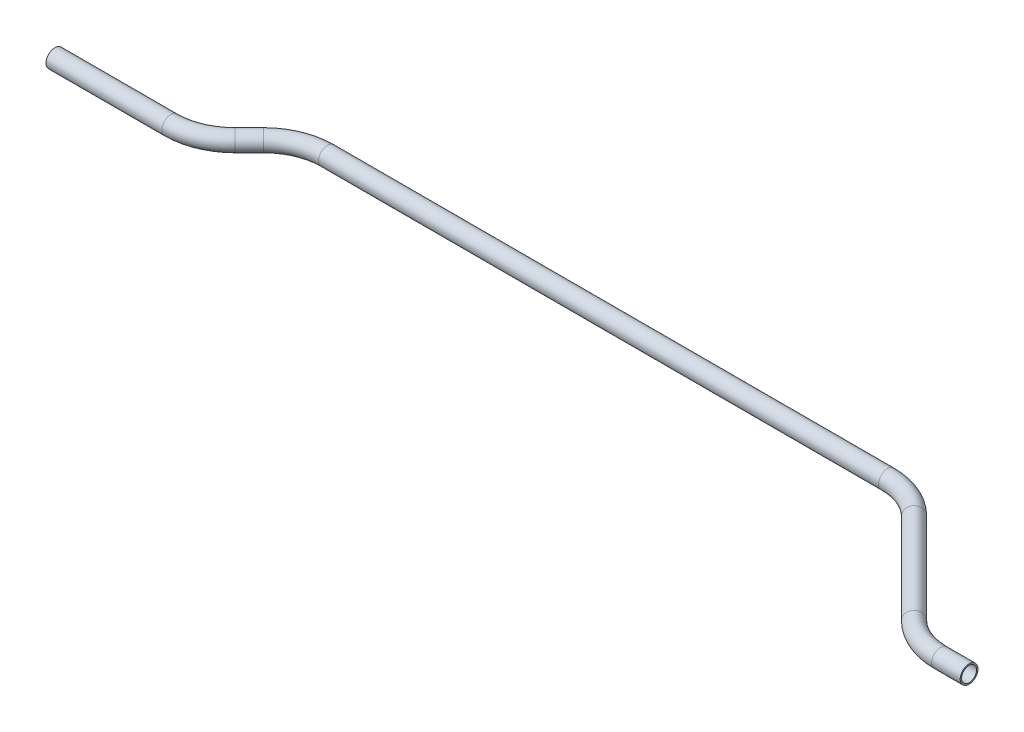
ISO-10303-21;
HEADER;
FILE_DESCRIPTION(('STEP AP214'),'2;1');
FILE_NAME('part.step','',(''),(''),'','','');
FILE_SCHEMA(('AUTOMOTIVE_DESIGN { 1 0 10303 214 1 1 1 1 }'));
ENDSEC;
DATA;
#1=APPLICATION_CONTEXT('core data for automotive mechanical design processes');
#2=APPLICATION_PROTOCOL_DEFINITION('international standard','automotive_design',2000,#1);
#3=PRODUCT_CONTEXT('',#1,'mechanical');
#4=PRODUCT('Part','Part','',(#3));
#5=PRODUCT_RELATED_PRODUCT_CATEGORY('part','',(#4));
#6=PRODUCT_DEFINITION_FORMATION('','',#4);
#7=PRODUCT_DEFINITION_CONTEXT('part definition',#1,'design');
#8=PRODUCT_DEFINITION('design','',#6,#7);
#9=PRODUCT_DEFINITION_SHAPE('','',#8);
#10=(LENGTH_UNIT() NAMED_UNIT(*) SI_UNIT(.MILLI.,.METRE.));
#11=(NAMED_UNIT(*) PLANE_ANGLE_UNIT() SI_UNIT($,.RADIAN.));
#12=(NAMED_UNIT(*) SI_UNIT($,.STERADIAN.) SOLID_ANGLE_UNIT());
#13=UNCERTAINTY_MEASURE_WITH_UNIT(LENGTH_MEASURE(1.E-05),#10,'distance_accuracy_value','');
#14=(GEOMETRIC_REPRESENTATION_CONTEXT(3) GLOBAL_UNCERTAINTY_ASSIGNED_CONTEXT((#13)) GLOBAL_UNIT_ASSIGNED_CONTEXT((#10,
#11,#12)) REPRESENTATION_CONTEXT('',''));
#15=CARTESIAN_POINT('',(0.,0.,0.));
#16=DIRECTION('',(0.,0.,1.));
#17=DIRECTION('',(1.,0.,0.));
#18=AXIS2_PLACEMENT_3D('',#15,#16,#17);
#19=CARTESIAN_POINT('',(0.,0.,0.));
#20=DIRECTION('',(1.,0.,0.));
#21=DIRECTION('',(0.,0.,-1.));
#22=AXIS2_PLACEMENT_3D('',#19,#20,#21);
#23=CYLINDRICAL_SURFACE('',#22,7.9375);
#24=CARTESIAN_POINT('',(103.327694910378,0.,0.));
#25=DIRECTION('',(1.,0.,0.));
#26=DIRECTION('',(0.,0.,-1.));
#27=AXIS2_PLACEMENT_3D('',#24,#25,#26);
#28=CIRCLE('',#27,7.9375);
#29=CARTESIAN_POINT('',(103.327694910378,0.,7.93750000000001));
#30=VERTEX_POINT('',#29);
#31=EDGE_CURVE('E54',#30,#30,#28,.T.);
#32=ORIENTED_EDGE('',*,*,#31,.F.);
#33=EDGE_LOOP('',(#32));
#34=FACE_BOUND('',#33,.T.);
#35=CARTESIAN_POINT('',(0.,0.,0.));
#36=DIRECTION('',(1.,0.,0.));
#37=DIRECTION('',(0.,0.,-1.));
#38=AXIS2_PLACEMENT_3D('',#35,#36,#37);
#39=CIRCLE('',#38,7.9375);
#40=CARTESIAN_POINT('',(0.,0.,-7.9375));
#41=VERTEX_POINT('',#40);
#42=EDGE_CURVE('E51',#41,#41,#39,.T.);
#43=ORIENTED_EDGE('',*,*,#42,.T.);
#44=EDGE_LOOP('',(#43));
#45=FACE_BOUND('',#44,.T.);
#46=ADVANCED_FACE('F30',(#34,#45),#23,.T.);
#47=CARTESIAN_POINT('',(103.327694910378,0.,-57.15));
#48=DIRECTION('',(0.,1.,0.));
#49=DIRECTION('',(0.,0.,1.));
#50=AXIS2_PLACEMENT_3D('',#47,#48,#49);
#51=TOROIDAL_SURFACE('',#50,57.15,7.9375);
#52=CARTESIAN_POINT('',(143.738847455189,0.,-16.7388474551889));
#53=DIRECTION('',(0.707106781186545,0.,-0.70710678118655));
#54=DIRECTION('',(-0.70710678118655,0.,-0.707106781186545));
#55=AXIS2_PLACEMENT_3D('',#52,#53,#54);
#56=CIRCLE('',#55,7.9375);
#57=CARTESIAN_POINT('',(149.351507530857,0.,-11.1261873795207));
#58=VERTEX_POINT('',#57);
#59=EDGE_CURVE('E57',#58,#58,#56,.T.);
#60=CARTESIAN_POINT('',(103.327694910378,0.,-57.15));
#61=DIRECTION('',(0.,1.,0.));
#62=DIRECTION('',(0.,0.,1.));
#63=AXIS2_PLACEMENT_3D('',#60,#61,#62);
#64=CIRCLE('',#63,65.0875);
#65=EDGE_CURVE('',#30,#58,#64,.T.);
#66=ORIENTED_EDGE('',*,*,#31,.T.);
#67=ORIENTED_EDGE('',*,*,#59,.F.);
#68=ORIENTED_EDGE('',*,*,#65,.T.);
#69=ORIENTED_EDGE('',*,*,#65,.F.);
#70=EDGE_LOOP('',(#66,#68,#67,#69));
#71=FACE_BOUND('',#70,.T.);
#72=ADVANCED_FACE('F114',(#71),#51,.T.);
#73=CARTESIAN_POINT('',(143.738847455189,0.,-16.7388474551889));
#74=DIRECTION('',(0.707106781186546,0.,-0.707106781186549));
#75=DIRECTION('',(-0.707106781186549,0.,-0.707106781186546));
#76=AXIS2_PLACEMENT_3D('',#73,#74,#75);
#77=CYLINDRICAL_SURFACE('',#76,7.9375);
#78=CARTESIAN_POINT('',(156.405011336411,0.,-29.4050113364111));
#79=DIRECTION('',(0.707106781186546,0.,-0.707106781186549));
#80=DIRECTION('',(-0.707106781186549,0.,-0.707106781186546));
#81=AXIS2_PLACEMENT_3D('',#78,#79,#80);
#82=CIRCLE('',#81,7.9375);
#83=CARTESIAN_POINT('',(150.792351260743,0.,-35.0176714120793));
#84=VERTEX_POINT('',#83);
#85=EDGE_CURVE('E60',#84,#84,#82,.T.);
#86=ORIENTED_EDGE('',*,*,#85,.F.);
#87=EDGE_LOOP('',(#86));
#88=FACE_BOUND('',#87,.T.);
#89=ORIENTED_EDGE('',*,*,#59,.T.);
#90=EDGE_LOOP('',(#89));
#91=FACE_BOUND('',#90,.T.);
#92=ADVANCED_FACE('F118',(#88,#91),#77,.T.);
#93=CARTESIAN_POINT('',(196.816163881222,0.,11.0061412084));
#94=DIRECTION('',(0.,-1.,0.));
#95=DIRECTION('',(0.,0.,-1.));
#96=AXIS2_PLACEMENT_3D('',#93,#94,#95);
#97=TOROIDAL_SURFACE('',#96,57.15,7.9375);
#98=CARTESIAN_POINT('',(196.816163881222,0.,-46.1438587916));
#99=DIRECTION('',(1.,0.,0.));
#100=DIRECTION('',(0.,0.,-1.));
#101=AXIS2_PLACEMENT_3D('',#98,#99,#100);
#102=CIRCLE('',#101,7.9375);
#103=CARTESIAN_POINT('',(196.816163881222,0.,-54.0813587916));
#104=VERTEX_POINT('',#103);
#105=EDGE_CURVE('E63',#104,#104,#102,.T.);
#106=CARTESIAN_POINT('',(196.816163881222,0.,11.0061412084));
#107=DIRECTION('',(0.,-1.,0.));
#108=DIRECTION('',(0.,0.,-1.));
#109=AXIS2_PLACEMENT_3D('',#106,#107,#108);
#110=CIRCLE('',#109,65.0875);
#111=EDGE_CURVE('',#84,#104,#110,.T.);
#112=ORIENTED_EDGE('',*,*,#85,.T.);
#113=ORIENTED_EDGE('',*,*,#105,.F.);
#114=ORIENTED_EDGE('',*,*,#111,.T.);
#115=ORIENTED_EDGE('',*,*,#111,.F.);
#116=EDGE_LOOP('',(#112,#114,#113,#115));
#117=FACE_BOUND('',#116,.T.);
#118=ADVANCED_FACE('F122',(#117),#97,.T.);
#119=CARTESIAN_POINT('',(196.816163881222,0.,-46.1438587916));
#120=DIRECTION('',(1.,0.,0.));
#121=DIRECTION('',(0.,0.,-1.));
#122=AXIS2_PLACEMENT_3D('',#119,#120,#121);
#123=CYLINDRICAL_SURFACE('',#122,7.9375);
#124=CARTESIAN_POINT('',(696.031788612355,0.,-46.1438587916));
#125=DIRECTION('',(1.,0.,0.));
#126=DIRECTION('',(0.,0.,-1.));
#127=AXIS2_PLACEMENT_3D('',#124,#125,#126);
#128=CIRCLE('',#127,7.9375);
#129=CARTESIAN_POINT('',(696.031788612355,0.,-54.0813587915999));
#130=VERTEX_POINT('',#129);
#131=EDGE_CURVE('E66',#130,#130,#128,.T.);
#132=ORIENTED_EDGE('',*,*,#131,.F.);
#133=EDGE_LOOP('',(#132));
#134=FACE_BOUND('',#133,.T.);
#135=ORIENTED_EDGE('',*,*,#105,.T.);
#136=EDGE_LOOP('',(#135));
#137=FACE_BOUND('',#136,.T.);
#138=ADVANCED_FACE('F126',(#134,#137),#123,.T.);
#139=CARTESIAN_POINT('',(696.031788612355,0.,11.0061412084));
#140=DIRECTION('',(0.,-1.,0.));
#141=DIRECTION('',(0.,0.,-1.));
#142=AXIS2_PLACEMENT_3D('',#139,#140,#141);
#143=TOROIDAL_SURFACE('',#142,57.15,7.9375);
#144=CARTESIAN_POINT('',(736.442941157166,0.,-29.4050113364111));
#145=DIRECTION('',(0.707106781186547,0.,0.707106781186548));
#146=DIRECTION('',(0.707106781186548,0.,-0.707106781186547));
#147=AXIS2_PLACEMENT_3D('',#144,#145,#146);
#148=CIRCLE('',#147,7.9375);
#149=CARTESIAN_POINT('',(742.055601232834,0.,-35.0176714120793));
#150=VERTEX_POINT('',#149);
#151=EDGE_CURVE('E69',#150,#150,#148,.T.);
#152=CARTESIAN_POINT('',(696.031788612355,0.,11.0061412084));
#153=DIRECTION('',(0.,-1.,0.));
#154=DIRECTION('',(0.,0.,-1.));
#155=AXIS2_PLACEMENT_3D('',#152,#153,#154);
#156=CIRCLE('',#155,65.0875);
#157=EDGE_CURVE('',#130,#150,#156,.T.);
#158=ORIENTED_EDGE('',*,*,#131,.T.);
#159=ORIENTED_EDGE('',*,*,#151,.F.);
#160=ORIENTED_EDGE('',*,*,#157,.T.);
#161=ORIENTED_EDGE('',*,*,#157,.F.);
#162=EDGE_LOOP('',(#158,#160,#159,#161));
#163=FACE_BOUND('',#162,.T.);
#164=ADVANCED_FACE('F88',(#163),#143,.T.);
#165=CARTESIAN_POINT('',(736.442941157166,0.,-29.4050113364111));
#166=DIRECTION('',(0.707106781186546,0.,0.707106781186549));
#167=DIRECTION('',(0.707106781186549,0.,-0.707106781186546));
#168=AXIS2_PLACEMENT_3D('',#165,#166,#167);
#169=CYLINDRICAL_SURFACE('',#168,7.9375);
#170=CARTESIAN_POINT('',(817.265246246788,0.,51.4172937532112));
#171=DIRECTION('',(0.707106781186546,0.,0.707106781186549));
#172=DIRECTION('',(0.707106781186549,0.,-0.707106781186546));
#173=AXIS2_PLACEMENT_3D('',#170,#171,#172);
#174=CIRCLE('',#173,7.9375);
#175=CARTESIAN_POINT('',(811.65258617112,0.,57.0299538288794));
#176=VERTEX_POINT('',#175);
#177=EDGE_CURVE('E71',#176,#176,#174,.T.);
#178=ORIENTED_EDGE('',*,*,#177,.F.);
#179=EDGE_LOOP('',(#178));
#180=FACE_BOUND('',#179,.T.);
#181=ORIENTED_EDGE('',*,*,#151,.T.);
#182=EDGE_LOOP('',(#181));
#183=FACE_BOUND('',#182,.T.);
#184=ADVANCED_FACE('F81',(#180,#183),#169,.T.);
#185=CARTESIAN_POINT('',(857.676398791599,0.,11.0061412084));
#186=DIRECTION('',(0.,1.,0.));
#187=DIRECTION('',(0.,0.,1.));
#188=AXIS2_PLACEMENT_3D('',#185,#186,#187);
#189=TOROIDAL_SURFACE('',#188,57.1500000000001,7.9375);
#190=CARTESIAN_POINT('',(857.676398791599,0.,68.1561412084));
#191=DIRECTION('',(1.,0.,0.));
#192=DIRECTION('',(0.,0.,-1.));
#193=AXIS2_PLACEMENT_3D('',#190,#191,#192);
#194=CIRCLE('',#193,7.9375);
#195=CARTESIAN_POINT('',(857.676398791599,0.,76.0936412084001));
#196=VERTEX_POINT('',#195);
#197=EDGE_CURVE('E34',#196,#196,#194,.T.);
#198=CARTESIAN_POINT('',(857.676398791599,0.,11.0061412084));
#199=DIRECTION('',(0.,1.,0.));
#200=DIRECTION('',(0.,0.,1.));
#201=AXIS2_PLACEMENT_3D('',#198,#199,#200);
#202=CIRCLE('',#201,65.0875000000001);
#203=EDGE_CURVE('',#176,#196,#202,.T.);
#204=ORIENTED_EDGE('',*,*,#177,.T.);
#205=ORIENTED_EDGE('',*,*,#197,.F.);
#206=ORIENTED_EDGE('',*,*,#203,.T.);
#207=ORIENTED_EDGE('',*,*,#203,.F.);
#208=EDGE_LOOP('',(#204,#206,#205,#207));
#209=FACE_BOUND('',#208,.T.);
#210=ADVANCED_FACE('F79',(#209),#189,.T.);
#211=CARTESIAN_POINT('',(857.676398791599,0.,68.1561412084));
#212=DIRECTION('',(1.,0.,0.));
#213=DIRECTION('',(0.,0.,-1.));
#214=AXIS2_PLACEMENT_3D('',#211,#212,#213);
#215=CYLINDRICAL_SURFACE('',#214,7.9375);
#216=CARTESIAN_POINT('',(883.076398791599,0.,68.1561412084));
#217=DIRECTION('',(1.,0.,0.));
#218=DIRECTION('',(0.,0.,-1.));
#219=AXIS2_PLACEMENT_3D('',#216,#217,#218);
#220=CIRCLE('',#219,7.9375);
#221=CARTESIAN_POINT('',(883.076398791599,0.,60.2186412084));
#222=VERTEX_POINT('',#221);
#223=EDGE_CURVE('E47',#222,#222,#220,.T.);
#224=ORIENTED_EDGE('',*,*,#223,.F.);
#225=EDGE_LOOP('',(#224));
#226=FACE_BOUND('',#225,.T.);
#227=ORIENTED_EDGE('',*,*,#197,.T.);
#228=EDGE_LOOP('',(#227));
#229=FACE_BOUND('',#228,.T.);
#230=ADVANCED_FACE('F32',(#226,#229),#215,.T.);
#231=CARTESIAN_POINT('',(0.,0.,0.));
#232=DIRECTION('',(1.,0.,0.));
#233=DIRECTION('',(0.,0.,-1.));
#234=AXIS2_PLACEMENT_3D('',#231,#232,#233);
#235=PLANE('',#234);
#236=CARTESIAN_POINT('',(0.,0.,0.));
#237=DIRECTION('',(1.,0.,0.));
#238=DIRECTION('',(0.,0.,-1.));
#239=AXIS2_PLACEMENT_3D('',#236,#237,#238);
#240=CIRCLE('',#239,6.6929);
#241=CARTESIAN_POINT('',(0.,0.,-6.6929));
#242=VERTEX_POINT('',#241);
#243=EDGE_CURVE('E50',#242,#242,#240,.F.);
#244=ORIENTED_EDGE('',*,*,#243,.F.);
#245=EDGE_LOOP('',(#244));
#246=FACE_BOUND('',#245,.T.);
#247=ORIENTED_EDGE('',*,*,#42,.F.);
#248=EDGE_LOOP('',(#247));
#249=FACE_BOUND('',#248,.T.);
#250=ADVANCED_FACE('F86',(#246,#249),#235,.F.);
#251=CARTESIAN_POINT('',(883.076398791599,0.,68.1561412084));
#252=DIRECTION('',(1.,0.,0.));
#253=DIRECTION('',(0.,0.,-1.));
#254=AXIS2_PLACEMENT_3D('',#251,#252,#253);
#255=PLANE('',#254);
#256=CARTESIAN_POINT('',(883.076398791599,0.,68.1561412084));
#257=DIRECTION('',(1.,0.,0.));
#258=DIRECTION('',(0.,0.,-1.));
#259=AXIS2_PLACEMENT_3D('',#256,#257,#258);
#260=CIRCLE('',#259,6.6929);
#261=CARTESIAN_POINT('',(883.076398791599,0.,61.4632412084));
#262=VERTEX_POINT('',#261);
#263=EDGE_CURVE('E10',#262,#262,#260,.F.);
#264=ORIENTED_EDGE('',*,*,#263,.T.);
#265=EDGE_LOOP('',(#264));
#266=FACE_BOUND('',#265,.T.);
#267=ORIENTED_EDGE('',*,*,#223,.T.);
#268=EDGE_LOOP('',(#267));
#269=FACE_BOUND('',#268,.T.);
#270=ADVANCED_FACE('F105',(#266,#269),#255,.T.);
#271=CARTESIAN_POINT('',(0.,0.,0.));
#272=DIRECTION('',(1.,0.,0.));
#273=DIRECTION('',(0.,0.,-1.));
#274=AXIS2_PLACEMENT_3D('',#271,#272,#273);
#275=CYLINDRICAL_SURFACE('',#274,6.6929);
#276=CARTESIAN_POINT('',(103.327694910378,0.,0.));
#277=DIRECTION('',(1.,0.,0.));
#278=DIRECTION('',(0.,0.,-1.));
#279=AXIS2_PLACEMENT_3D('',#276,#277,#278);
#280=CIRCLE('',#279,6.6929);
#281=CARTESIAN_POINT('',(103.327694910378,0.,6.69290000000001));
#282=VERTEX_POINT('',#281);
#283=EDGE_CURVE('E279',#282,#282,#280,.F.);
#284=ORIENTED_EDGE('',*,*,#283,.F.);
#285=EDGE_LOOP('',(#284));
#286=FACE_BOUND('',#285,.T.);
#287=ORIENTED_EDGE('',*,*,#243,.T.);
#288=EDGE_LOOP('',(#287));
#289=FACE_BOUND('',#288,.T.);
#290=ADVANCED_FACE('F108',(#286,#289),#275,.F.);
#291=CARTESIAN_POINT('',(103.327694910378,0.,-57.15));
#292=DIRECTION('',(0.,1.,0.));
#293=DIRECTION('',(0.,0.,1.));
#294=AXIS2_PLACEMENT_3D('',#291,#292,#293);
#295=TOROIDAL_SURFACE('',#294,57.15,6.6929);
#296=CARTESIAN_POINT('',(143.738847455189,0.,-16.7388474551889));
#297=DIRECTION('',(0.707106781186545,0.,-0.70710678118655));
#298=DIRECTION('',(-0.70710678118655,0.,-0.707106781186545));
#299=AXIS2_PLACEMENT_3D('',#296,#297,#298);
#300=CIRCLE('',#299,6.6929);
#301=CARTESIAN_POINT('',(148.471442430992,0.,-12.0062524793855));
#302=VERTEX_POINT('',#301);
#303=EDGE_CURVE('E276',#302,#302,#300,.F.);
#304=CARTESIAN_POINT('',(103.327694910378,0.,-57.15));
#305=DIRECTION('',(0.,1.,0.));
#306=DIRECTION('',(0.,0.,1.));
#307=AXIS2_PLACEMENT_3D('',#304,#305,#306);
#308=CIRCLE('',#307,63.8429);
#309=EDGE_CURVE('',#282,#302,#308,.T.);
#310=ORIENTED_EDGE('',*,*,#283,.T.);
#311=ORIENTED_EDGE('',*,*,#303,.F.);
#312=ORIENTED_EDGE('',*,*,#309,.T.);
#313=ORIENTED_EDGE('',*,*,#309,.F.);
#314=EDGE_LOOP('',(#310,#312,#311,#313));
#315=FACE_BOUND('',#314,.T.);
#316=ADVANCED_FACE('F187',(#315),#295,.F.);
#317=CARTESIAN_POINT('',(143.738847455189,0.,-16.7388474551889));
#318=DIRECTION('',(0.707106781186546,0.,-0.707106781186549));
#319=DIRECTION('',(-0.707106781186549,0.,-0.707106781186546));
#320=AXIS2_PLACEMENT_3D('',#317,#318,#319);
#321=CYLINDRICAL_SURFACE('',#320,6.6929);
#322=CARTESIAN_POINT('',(156.405011336411,0.,-29.4050113364111));
#323=DIRECTION('',(0.707106781186546,0.,-0.707106781186549));
#324=DIRECTION('',(-0.707106781186549,0.,-0.707106781186546));
#325=AXIS2_PLACEMENT_3D('',#322,#323,#324);
#326=CIRCLE('',#325,6.6929);
#327=CARTESIAN_POINT('',(151.672416360608,0.,-34.1376063122145));
#328=VERTEX_POINT('',#327);
#329=EDGE_CURVE('E273',#328,#328,#326,.F.);
#330=ORIENTED_EDGE('',*,*,#329,.F.);
#331=EDGE_LOOP('',(#330));
#332=FACE_BOUND('',#331,.T.);
#333=ORIENTED_EDGE('',*,*,#303,.T.);
#334=EDGE_LOOP('',(#333));
#335=FACE_BOUND('',#334,.T.);
#336=ADVANCED_FACE('F197',(#332,#335),#321,.F.);
#337=CARTESIAN_POINT('',(196.816163881222,0.,11.0061412084));
#338=DIRECTION('',(0.,-1.,0.));
#339=DIRECTION('',(0.,0.,-1.));
#340=AXIS2_PLACEMENT_3D('',#337,#338,#339);
#341=TOROIDAL_SURFACE('',#340,57.15,6.6929);
#342=CARTESIAN_POINT('',(196.816163881222,0.,-46.1438587916));
#343=DIRECTION('',(1.,0.,0.));
#344=DIRECTION('',(0.,0.,-1.));
#345=AXIS2_PLACEMENT_3D('',#342,#343,#344);
#346=CIRCLE('',#345,6.6929);
#347=CARTESIAN_POINT('',(196.816163881222,0.,-52.8367587916));
#348=VERTEX_POINT('',#347);
#349=EDGE_CURVE('E268',#348,#348,#346,.F.);
#350=CARTESIAN_POINT('',(196.816163881222,0.,11.0061412084));
#351=DIRECTION('',(0.,-1.,0.));
#352=DIRECTION('',(0.,0.,-1.));
#353=AXIS2_PLACEMENT_3D('',#350,#351,#352);
#354=CIRCLE('',#353,63.8429);
#355=EDGE_CURVE('',#328,#348,#354,.T.);
#356=ORIENTED_EDGE('',*,*,#329,.T.);
#357=ORIENTED_EDGE('',*,*,#349,.F.);
#358=ORIENTED_EDGE('',*,*,#355,.T.);
#359=ORIENTED_EDGE('',*,*,#355,.F.);
#360=EDGE_LOOP('',(#356,#358,#357,#359));
#361=FACE_BOUND('',#360,.T.);
#362=ADVANCED_FACE('F207',(#361),#341,.F.);
#363=CARTESIAN_POINT('',(196.816163881222,0.,-46.1438587916));
#364=DIRECTION('',(1.,0.,0.));
#365=DIRECTION('',(0.,0.,-1.));
#366=AXIS2_PLACEMENT_3D('',#363,#364,#365);
#367=CYLINDRICAL_SURFACE('',#366,6.6929);
#368=CARTESIAN_POINT('',(696.031788612355,0.,-46.1438587916));
#369=DIRECTION('',(1.,0.,0.));
#370=DIRECTION('',(0.,0.,-1.));
#371=AXIS2_PLACEMENT_3D('',#368,#369,#370);
#372=CIRCLE('',#371,6.6929);
#373=CARTESIAN_POINT('',(696.031788612355,0.,-52.8367587915999));
#374=VERTEX_POINT('',#373);
#375=EDGE_CURVE('E265',#374,#374,#372,.F.);
#376=ORIENTED_EDGE('',*,*,#375,.F.);
#377=EDGE_LOOP('',(#376));
#378=FACE_BOUND('',#377,.T.);
#379=ORIENTED_EDGE('',*,*,#349,.T.);
#380=EDGE_LOOP('',(#379));
#381=FACE_BOUND('',#380,.T.);
#382=ADVANCED_FACE('F217',(#378,#381),#367,.F.);
#383=CARTESIAN_POINT('',(696.031788612355,0.,11.0061412084));
#384=DIRECTION('',(0.,-1.,0.));
#385=DIRECTION('',(0.,0.,-1.));
#386=AXIS2_PLACEMENT_3D('',#383,#384,#385);
#387=TOROIDAL_SURFACE('',#386,57.15,6.6929);
#388=CARTESIAN_POINT('',(736.442941157166,0.,-29.4050113364111));
#389=DIRECTION('',(0.707106781186547,0.,0.707106781186548));
#390=DIRECTION('',(0.707106781186548,0.,-0.707106781186547));
#391=AXIS2_PLACEMENT_3D('',#388,#389,#390);
#392=CIRCLE('',#391,6.6929);
#393=CARTESIAN_POINT('',(741.17553613297,0.,-34.1376063122146));
#394=VERTEX_POINT('',#393);
#395=EDGE_CURVE('E264',#394,#394,#392,.F.);
#396=CARTESIAN_POINT('',(696.031788612355,0.,11.0061412084));
#397=DIRECTION('',(0.,-1.,0.));
#398=DIRECTION('',(0.,0.,-1.));
#399=AXIS2_PLACEMENT_3D('',#396,#397,#398);
#400=CIRCLE('',#399,63.8429);
#401=EDGE_CURVE('',#374,#394,#400,.T.);
#402=ORIENTED_EDGE('',*,*,#375,.T.);
#403=ORIENTED_EDGE('',*,*,#395,.F.);
#404=ORIENTED_EDGE('',*,*,#401,.T.);
#405=ORIENTED_EDGE('',*,*,#401,.F.);
#406=EDGE_LOOP('',(#402,#404,#403,#405));
#407=FACE_BOUND('',#406,.T.);
#408=ADVANCED_FACE('F227',(#407),#387,.F.);
#409=CARTESIAN_POINT('',(736.442941157166,0.,-29.4050113364111));
#410=DIRECTION('',(0.707106781186546,0.,0.707106781186549));
#411=DIRECTION('',(0.707106781186549,0.,-0.707106781186546));
#412=AXIS2_PLACEMENT_3D('',#409,#410,#411);
#413=CYLINDRICAL_SURFACE('',#412,6.6929);
#414=CARTESIAN_POINT('',(817.265246246788,0.,51.4172937532112));
#415=DIRECTION('',(0.707106781186546,0.,0.707106781186549));
#416=DIRECTION('',(0.707106781186549,0.,-0.707106781186546));
#417=AXIS2_PLACEMENT_3D('',#414,#415,#416);
#418=CIRCLE('',#417,6.6929);
#419=CARTESIAN_POINT('',(812.532651270985,0.,56.1498887290146));
#420=VERTEX_POINT('',#419);
#421=EDGE_CURVE('E43',#420,#420,#418,.F.);
#422=ORIENTED_EDGE('',*,*,#421,.F.);
#423=EDGE_LOOP('',(#422));
#424=FACE_BOUND('',#423,.T.);
#425=ORIENTED_EDGE('',*,*,#395,.T.);
#426=EDGE_LOOP('',(#425));
#427=FACE_BOUND('',#426,.T.);
#428=ADVANCED_FACE('F99',(#424,#427),#413,.F.);
#429=CARTESIAN_POINT('',(857.676398791599,0.,11.0061412084));
#430=DIRECTION('',(0.,1.,0.));
#431=DIRECTION('',(0.,0.,1.));
#432=AXIS2_PLACEMENT_3D('',#429,#430,#431);
#433=TOROIDAL_SURFACE('',#432,57.1500000000001,6.6929);
#434=CARTESIAN_POINT('',(857.676398791599,0.,68.1561412084));
#435=DIRECTION('',(1.,0.,0.));
#436=DIRECTION('',(0.,0.,-1.));
#437=AXIS2_PLACEMENT_3D('',#434,#435,#436);
#438=CIRCLE('',#437,6.6929);
#439=CARTESIAN_POINT('',(857.676398791599,0.,74.8490412084001));
#440=VERTEX_POINT('',#439);
#441=EDGE_CURVE('E38',#440,#440,#438,.F.);
#442=CARTESIAN_POINT('',(857.676398791599,0.,11.0061412084));
#443=DIRECTION('',(0.,1.,0.));
#444=DIRECTION('',(0.,0.,1.));
#445=AXIS2_PLACEMENT_3D('',#442,#443,#444);
#446=CIRCLE('',#445,63.8429000000001);
#447=EDGE_CURVE('',#420,#440,#446,.T.);
#448=ORIENTED_EDGE('',*,*,#421,.T.);
#449=ORIENTED_EDGE('',*,*,#441,.F.);
#450=ORIENTED_EDGE('',*,*,#447,.T.);
#451=ORIENTED_EDGE('',*,*,#447,.F.);
#452=EDGE_LOOP('',(#448,#450,#449,#451));
#453=FACE_BOUND('',#452,.T.);
#454=ADVANCED_FACE('F93',(#453),#433,.F.);
#455=CARTESIAN_POINT('',(857.676398791599,0.,68.1561412084));
#456=DIRECTION('',(1.,0.,0.));
#457=DIRECTION('',(0.,0.,-1.));
#458=AXIS2_PLACEMENT_3D('',#455,#456,#457);
#459=CYLINDRICAL_SURFACE('',#458,6.6929);
#460=ORIENTED_EDGE('',*,*,#263,.F.);
#461=EDGE_LOOP('',(#460));
#462=FACE_BOUND('',#461,.T.);
#463=ORIENTED_EDGE('',*,*,#441,.T.);
#464=EDGE_LOOP('',(#463));
#465=FACE_BOUND('',#464,.T.);
#466=ADVANCED_FACE('F91',(#462,#465),#459,.F.);
#467=CLOSED_SHELL('',(#46,#72,#92,#118,#138,#164,#184,#210,#230,#250,#270,#290,#316,#336,#362,
#382,#408,#428,#454,#466));
#468=MANIFOLD_SOLID_BREP('B2',#467);
#469=ADVANCED_BREP_SHAPE_REPRESENTATION('',(#18,#468),#14);
#470=SHAPE_DEFINITION_REPRESENTATION(#9,#469);
ENDSEC;
END-ISO-10303-21;
